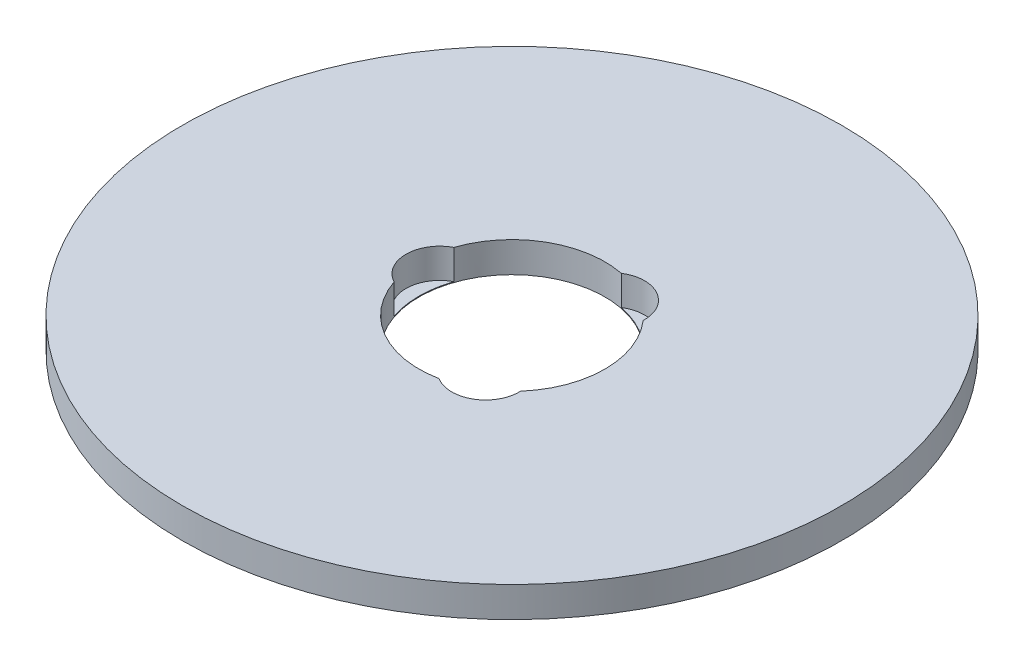
ISO-10303-21;
HEADER;
FILE_DESCRIPTION(('STEP AP214'),'2;1');
FILE_NAME('part.step','',(''),(''),'','','');
FILE_SCHEMA(('AUTOMOTIVE_DESIGN { 1 0 10303 214 1 1 1 1 }'));
ENDSEC;
DATA;
#1=APPLICATION_CONTEXT('core data for automotive mechanical design processes');
#2=APPLICATION_PROTOCOL_DEFINITION('international standard','automotive_design',2000,#1);
#3=PRODUCT_CONTEXT('',#1,'mechanical');
#4=PRODUCT('Part','Part','',(#3));
#5=PRODUCT_RELATED_PRODUCT_CATEGORY('part','',(#4));
#6=PRODUCT_DEFINITION_FORMATION('','',#4);
#7=PRODUCT_DEFINITION_CONTEXT('part definition',#1,'design');
#8=PRODUCT_DEFINITION('design','',#6,#7);
#9=PRODUCT_DEFINITION_SHAPE('','',#8);
#10=(LENGTH_UNIT() NAMED_UNIT(*) SI_UNIT(.MILLI.,.METRE.));
#11=(NAMED_UNIT(*) PLANE_ANGLE_UNIT() SI_UNIT($,.RADIAN.));
#12=(NAMED_UNIT(*) SI_UNIT($,.STERADIAN.) SOLID_ANGLE_UNIT());
#13=UNCERTAINTY_MEASURE_WITH_UNIT(LENGTH_MEASURE(1.E-05),#10,'distance_accuracy_value','');
#14=(GEOMETRIC_REPRESENTATION_CONTEXT(3) GLOBAL_UNCERTAINTY_ASSIGNED_CONTEXT((#13)) GLOBAL_UNIT_ASSIGNED_CONTEXT((#10,
#11,#12)) REPRESENTATION_CONTEXT('',''));
#15=CARTESIAN_POINT('',(0.,0.,0.));
#16=DIRECTION('',(0.,0.,1.));
#17=DIRECTION('',(1.,0.,0.));
#18=AXIS2_PLACEMENT_3D('',#15,#16,#17);
#19=CARTESIAN_POINT('',(0.,9.,0.));
#20=DIRECTION('',(0.,-1.,0.));
#21=DIRECTION('',(0.,0.,-1.));
#22=AXIS2_PLACEMENT_3D('',#19,#20,#21);
#23=CYLINDRICAL_SURFACE('',#22,97.5);
#24=CARTESIAN_POINT('',(0.,9.,0.));
#25=DIRECTION('',(0.,1.,0.));
#26=DIRECTION('',(0.,0.,1.));
#27=AXIS2_PLACEMENT_3D('',#24,#25,#26);
#28=CIRCLE('',#27,97.5);
#29=CARTESIAN_POINT('',(0.,9.,97.5));
#30=VERTEX_POINT('',#29);
#31=EDGE_CURVE('E130',#30,#30,#28,.T.);
#32=ORIENTED_EDGE('',*,*,#31,.F.);
#33=EDGE_LOOP('',(#32));
#34=FACE_BOUND('',#33,.T.);
#35=CARTESIAN_POINT('',(0.,0.,0.));
#36=DIRECTION('',(0.,1.,0.));
#37=DIRECTION('',(0.,0.,1.));
#38=AXIS2_PLACEMENT_3D('',#35,#36,#37);
#39=CIRCLE('',#38,97.5);
#40=CARTESIAN_POINT('',(0.,0.,97.5));
#41=VERTEX_POINT('',#40);
#42=EDGE_CURVE('E117',#41,#41,#39,.T.);
#43=ORIENTED_EDGE('',*,*,#42,.T.);
#44=EDGE_LOOP('',(#43));
#45=FACE_BOUND('',#44,.T.);
#46=ADVANCED_FACE('F39',(#34,#45),#23,.T.);
#47=CARTESIAN_POINT('',(0.,9.,0.));
#48=DIRECTION('',(0.,1.,0.));
#49=DIRECTION('',(0.,0.,1.));
#50=AXIS2_PLACEMENT_3D('',#47,#48,#49);
#51=PLANE('',#50);
#52=CARTESIAN_POINT('',(10.6886704275713,9.,18.5133202459122));
#53=DIRECTION('',(0.,1.,0.));
#54=DIRECTION('',(0.866025403784436,0.,-0.500000000000004));
#55=AXIS2_PLACEMENT_3D('',#52,#53,#54);
#56=CIRCLE('',#55,10.);
#57=CARTESIAN_POINT('',(5.35671274977431,9.,26.9732391179926));
#58=VERTEX_POINT('',#57);
#59=CARTESIAN_POINT('',(20.6811539236468,9.,18.1256688810766));
#60=VERTEX_POINT('',#59);
#61=EDGE_CURVE('E148',#58,#60,#56,.T.);
#62=ORIENTED_EDGE('',*,*,#61,.F.);
#63=CARTESIAN_POINT('',(0.,9.,0.));
#64=DIRECTION('',(0.,1.,0.));
#65=DIRECTION('',(0.,0.,1.));
#66=AXIS2_PLACEMENT_3D('',#63,#64,#65);
#67=CIRCLE('',#66,27.5);
#68=CARTESIAN_POINT('',(-26.0378666734209,9.,8.84757023691586));
#69=VERTEX_POINT('',#68);
#70=EDGE_CURVE('E113',#69,#58,#67,.T.);
#71=ORIENTED_EDGE('',*,*,#70,.F.);
#72=CARTESIAN_POINT('',(-21.3773408551423,9.,0.));
#73=DIRECTION('',(0.,1.,0.));
#74=DIRECTION('',(0.,0.,1.));
#75=AXIS2_PLACEMENT_3D('',#72,#73,#74);
#76=CIRCLE('',#75,10.);
#77=CARTESIAN_POINT('',(-26.0378666734209,9.,-8.84757023691586));
#78=VERTEX_POINT('',#77);
#79=EDGE_CURVE('E125',#78,#69,#76,.T.);
#80=ORIENTED_EDGE('',*,*,#79,.F.);
#81=CARTESIAN_POINT('',(5.35671274977394,9.,-26.9732391179927));
#82=VERTEX_POINT('',#81);
#83=EDGE_CURVE('E107',#82,#78,#67,.T.);
#84=ORIENTED_EDGE('',*,*,#83,.F.);
#85=CARTESIAN_POINT('',(10.688670427571,9.,-18.5133202459123));
#86=DIRECTION('',(0.,1.,0.));
#87=DIRECTION('',(-0.866025403784443,0.,-0.499999999999992));
#88=AXIS2_PLACEMENT_3D('',#85,#86,#87);
#89=CIRCLE('',#88,10.);
#90=CARTESIAN_POINT('',(20.6811539236465,9.,-18.1256688810769));
#91=VERTEX_POINT('',#90);
#92=EDGE_CURVE('E95',#91,#82,#89,.T.);
#93=ORIENTED_EDGE('',*,*,#92,.F.);
#94=EDGE_CURVE('E106',#60,#91,#67,.T.);
#95=ORIENTED_EDGE('',*,*,#94,.F.);
#96=EDGE_LOOP('',(#62,#71,#80,#84,#93,#95));
#97=FACE_BOUND('',#96,.T.);
#98=ORIENTED_EDGE('',*,*,#31,.T.);
#99=EDGE_LOOP('',(#98));
#100=FACE_BOUND('',#99,.T.);
#101=ADVANCED_FACE('F102',(#97,#100),#51,.T.);
#102=CARTESIAN_POINT('',(0.,0.,0.));
#103=DIRECTION('',(0.,1.,0.));
#104=DIRECTION('',(0.,0.,1.));
#105=AXIS2_PLACEMENT_3D('',#102,#103,#104);
#106=PLANE('',#105);
#107=CARTESIAN_POINT('',(0.,0.,0.));
#108=DIRECTION('',(0.,1.,0.));
#109=DIRECTION('',(0.,0.,1.));
#110=AXIS2_PLACEMENT_3D('',#107,#108,#109);
#111=CIRCLE('',#110,27.5);
#112=CARTESIAN_POINT('',(0.,0.,27.5));
#113=VERTEX_POINT('',#112);
#114=EDGE_CURVE('E118',#113,#113,#111,.T.);
#115=ORIENTED_EDGE('',*,*,#114,.T.);
#116=EDGE_LOOP('',(#115));
#117=FACE_BOUND('',#116,.T.);
#118=ORIENTED_EDGE('',*,*,#42,.F.);
#119=EDGE_LOOP('',(#118));
#120=FACE_BOUND('',#119,.T.);
#121=ADVANCED_FACE('F161',(#117,#120),#106,.F.);
#122=CARTESIAN_POINT('',(0.,9.,0.));
#123=DIRECTION('',(0.,-1.,0.));
#124=DIRECTION('',(0.,0.,-1.));
#125=AXIS2_PLACEMENT_3D('',#122,#123,#124);
#126=CYLINDRICAL_SURFACE('',#125,27.5);
#127=DIRECTION('',(0.,1.,0.));
#128=VECTOR('',#127,1.);
#129=CARTESIAN_POINT('',(5.35671274977432,4.60725750616183,26.9732391179926));
#130=LINE('',#129,#128);
#131=CARTESIAN_POINT('',(5.35671274977431,0.214515012323663,26.9732391179926));
#132=VERTEX_POINT('',#131);
#133=EDGE_CURVE('E11',#132,#58,#130,.T.);
#134=ORIENTED_EDGE('',*,*,#133,.F.);
#135=CARTESIAN_POINT('',(0.,0.214515012323663,0.));
#136=DIRECTION('',(0.,1.,0.));
#137=DIRECTION('',(0.,0.,1.));
#138=AXIS2_PLACEMENT_3D('',#135,#136,#137);
#139=CIRCLE('',#138,27.5);
#140=CARTESIAN_POINT('',(20.6811539236468,0.214515012323663,18.1256688810766));
#141=VERTEX_POINT('',#140);
#142=EDGE_CURVE('E100',#132,#141,#139,.T.);
#143=ORIENTED_EDGE('',*,*,#142,.T.);
#144=DIRECTION('',(0.,1.,0.));
#145=VECTOR('',#144,1.);
#146=CARTESIAN_POINT('',(20.6811539236468,4.60725750616183,18.1256688810767));
#147=LINE('',#146,#145);
#148=EDGE_CURVE('E46',#60,#141,#147,.F.);
#149=ORIENTED_EDGE('',*,*,#148,.F.);
#150=ORIENTED_EDGE('',*,*,#94,.T.);
#151=DIRECTION('',(0.,1.,0.));
#152=VECTOR('',#151,1.);
#153=CARTESIAN_POINT('',(20.6811539236465,4.60725750616183,-18.1256688810769));
#154=LINE('',#153,#152);
#155=CARTESIAN_POINT('',(20.6811539236465,0.214515012323663,-18.1256688810769));
#156=VERTEX_POINT('',#155);
#157=EDGE_CURVE('E90',#156,#91,#154,.T.);
#158=ORIENTED_EDGE('',*,*,#157,.F.);
#159=CARTESIAN_POINT('',(0.,0.214515012323663,0.));
#160=DIRECTION('',(0.,1.,0.));
#161=DIRECTION('',(0.,0.,1.));
#162=AXIS2_PLACEMENT_3D('',#159,#160,#161);
#163=CIRCLE('',#162,27.5);
#164=CARTESIAN_POINT('',(5.35671274977394,0.214515012323663,-26.9732391179927));
#165=VERTEX_POINT('',#164);
#166=EDGE_CURVE('E143',#156,#165,#163,.T.);
#167=ORIENTED_EDGE('',*,*,#166,.T.);
#168=DIRECTION('',(0.,1.,0.));
#169=VECTOR('',#168,1.);
#170=CARTESIAN_POINT('',(5.35671274977395,4.60725750616183,-26.9732391179927));
#171=LINE('',#170,#169);
#172=EDGE_CURVE('E98',#82,#165,#171,.F.);
#173=ORIENTED_EDGE('',*,*,#172,.F.);
#174=ORIENTED_EDGE('',*,*,#83,.T.);
#175=DIRECTION('',(0.,1.,0.));
#176=VECTOR('',#175,1.);
#177=CARTESIAN_POINT('',(-26.0378666734209,4.60725750616183,-8.84757023691586));
#178=LINE('',#177,#176);
#179=CARTESIAN_POINT('',(-26.0378666734209,0.214515012323663,-8.84757023691586));
#180=VERTEX_POINT('',#179);
#181=EDGE_CURVE('E137',#180,#78,#178,.T.);
#182=ORIENTED_EDGE('',*,*,#181,.F.);
#183=CARTESIAN_POINT('',(0.,0.214515012323663,0.));
#184=DIRECTION('',(0.,1.,0.));
#185=DIRECTION('',(0.,0.,1.));
#186=AXIS2_PLACEMENT_3D('',#183,#184,#185);
#187=CIRCLE('',#186,27.5);
#188=CARTESIAN_POINT('',(-26.0378666734209,0.214515012323663,8.84757023691586));
#189=VERTEX_POINT('',#188);
#190=EDGE_CURVE('E128',#180,#189,#187,.T.);
#191=ORIENTED_EDGE('',*,*,#190,.T.);
#192=DIRECTION('',(0.,1.,0.));
#193=VECTOR('',#192,1.);
#194=CARTESIAN_POINT('',(-26.0378666734209,4.60725750616183,8.84757023691586));
#195=LINE('',#194,#193);
#196=EDGE_CURVE('E134',#69,#189,#195,.F.);
#197=ORIENTED_EDGE('',*,*,#196,.F.);
#198=ORIENTED_EDGE('',*,*,#70,.T.);
#199=EDGE_LOOP('',(#134,#143,#149,#150,#158,#167,#173,#174,#182,#191,#197,#198));
#200=FACE_BOUND('',#199,.T.);
#201=ORIENTED_EDGE('',*,*,#114,.F.);
#202=EDGE_LOOP('',(#201));
#203=FACE_BOUND('',#202,.T.);
#204=ADVANCED_FACE('F115',(#200,#203),#126,.F.);
#205=CARTESIAN_POINT('',(-21.3773408551423,0.214515012323663,0.));
#206=DIRECTION('',(0.,1.,0.));
#207=DIRECTION('',(0.,0.,1.));
#208=AXIS2_PLACEMENT_3D('',#205,#206,#207);
#209=CYLINDRICAL_SURFACE('',#208,10.);
#210=ORIENTED_EDGE('',*,*,#181,.T.);
#211=ORIENTED_EDGE('',*,*,#79,.T.);
#212=ORIENTED_EDGE('',*,*,#196,.T.);
#213=CARTESIAN_POINT('',(-21.3773408551423,0.214515012323663,0.));
#214=DIRECTION('',(0.,1.,0.));
#215=DIRECTION('',(0.,0.,1.));
#216=AXIS2_PLACEMENT_3D('',#213,#214,#215);
#217=CIRCLE('',#216,10.);
#218=EDGE_CURVE('E127',#180,#189,#217,.T.);
#219=ORIENTED_EDGE('',*,*,#218,.F.);
#220=EDGE_LOOP('',(#210,#211,#212,#219));
#221=FACE_BOUND('',#220,.T.);
#222=ADVANCED_FACE('F175',(#221),#209,.F.);
#223=CARTESIAN_POINT('',(-21.3773408551423,0.214515012323663,0.));
#224=DIRECTION('',(0.,1.,0.));
#225=DIRECTION('',(0.,0.,1.));
#226=AXIS2_PLACEMENT_3D('',#223,#224,#225);
#227=PLANE('',#226);
#228=ORIENTED_EDGE('',*,*,#218,.T.);
#229=ORIENTED_EDGE('',*,*,#190,.F.);
#230=EDGE_LOOP('',(#228,#229));
#231=FACE_BOUND('',#230,.T.);
#232=ADVANCED_FACE('F176',(#231),#227,.T.);
#233=CARTESIAN_POINT('',(10.688670427571,0.214515012323663,-18.5133202459123));
#234=DIRECTION('',(0.,1.,0.));
#235=DIRECTION('',(0.,0.,1.));
#236=AXIS2_PLACEMENT_3D('',#233,#234,#235);
#237=CYLINDRICAL_SURFACE('',#236,10.);
#238=ORIENTED_EDGE('',*,*,#157,.T.);
#239=ORIENTED_EDGE('',*,*,#92,.T.);
#240=ORIENTED_EDGE('',*,*,#172,.T.);
#241=CARTESIAN_POINT('',(10.688670427571,0.214515012323663,-18.5133202459123));
#242=DIRECTION('',(0.,1.,0.));
#243=DIRECTION('',(-0.866025403784443,0.,-0.499999999999992));
#244=AXIS2_PLACEMENT_3D('',#241,#242,#243);
#245=CIRCLE('',#244,10.);
#246=EDGE_CURVE('E56',#156,#165,#245,.T.);
#247=ORIENTED_EDGE('',*,*,#246,.F.);
#248=EDGE_LOOP('',(#238,#239,#240,#247));
#249=FACE_BOUND('',#248,.T.);
#250=ADVANCED_FACE('F93',(#249),#237,.F.);
#251=CARTESIAN_POINT('',(10.688670427571,0.214515012323663,-18.5133202459123));
#252=DIRECTION('',(0.,1.,0.));
#253=DIRECTION('',(-0.866025403784443,0.,-0.499999999999992));
#254=AXIS2_PLACEMENT_3D('',#251,#252,#253);
#255=PLANE('',#254);
#256=ORIENTED_EDGE('',*,*,#246,.T.);
#257=ORIENTED_EDGE('',*,*,#166,.F.);
#258=EDGE_LOOP('',(#256,#257));
#259=FACE_BOUND('',#258,.T.);
#260=ADVANCED_FACE('F153',(#259),#255,.T.);
#261=CARTESIAN_POINT('',(10.6886704275713,0.214515012323663,18.5133202459122));
#262=DIRECTION('',(0.,1.,0.));
#263=DIRECTION('',(0.,0.,1.));
#264=AXIS2_PLACEMENT_3D('',#261,#262,#263);
#265=CYLINDRICAL_SURFACE('',#264,10.);
#266=ORIENTED_EDGE('',*,*,#133,.T.);
#267=ORIENTED_EDGE('',*,*,#61,.T.);
#268=ORIENTED_EDGE('',*,*,#148,.T.);
#269=CARTESIAN_POINT('',(10.6886704275713,0.214515012323663,18.5133202459122));
#270=DIRECTION('',(0.,1.,0.));
#271=DIRECTION('',(0.866025403784436,0.,-0.500000000000004));
#272=AXIS2_PLACEMENT_3D('',#269,#270,#271);
#273=CIRCLE('',#272,10.);
#274=EDGE_CURVE('E55',#132,#141,#273,.T.);
#275=ORIENTED_EDGE('',*,*,#274,.F.);
#276=EDGE_LOOP('',(#266,#267,#268,#275));
#277=FACE_BOUND('',#276,.T.);
#278=ADVANCED_FACE('F144',(#277),#265,.F.);
#279=CARTESIAN_POINT('',(10.6886704275713,0.214515012323663,18.5133202459122));
#280=DIRECTION('',(0.,1.,0.));
#281=DIRECTION('',(0.866025403784436,0.,-0.500000000000004));
#282=AXIS2_PLACEMENT_3D('',#279,#280,#281);
#283=PLANE('',#282);
#284=ORIENTED_EDGE('',*,*,#274,.T.);
#285=ORIENTED_EDGE('',*,*,#142,.F.);
#286=EDGE_LOOP('',(#284,#285));
#287=FACE_BOUND('',#286,.T.);
#288=ADVANCED_FACE('F150',(#287),#283,.T.);
#289=CLOSED_SHELL('',(#46,#101,#121,#204,#222,#232,#250,#260,#278,#288));
#290=MANIFOLD_SOLID_BREP('B2',#289);
#291=ADVANCED_BREP_SHAPE_REPRESENTATION('',(#18,#290),#14);
#292=SHAPE_DEFINITION_REPRESENTATION(#9,#291);
ENDSEC;
END-ISO-10303-21;
